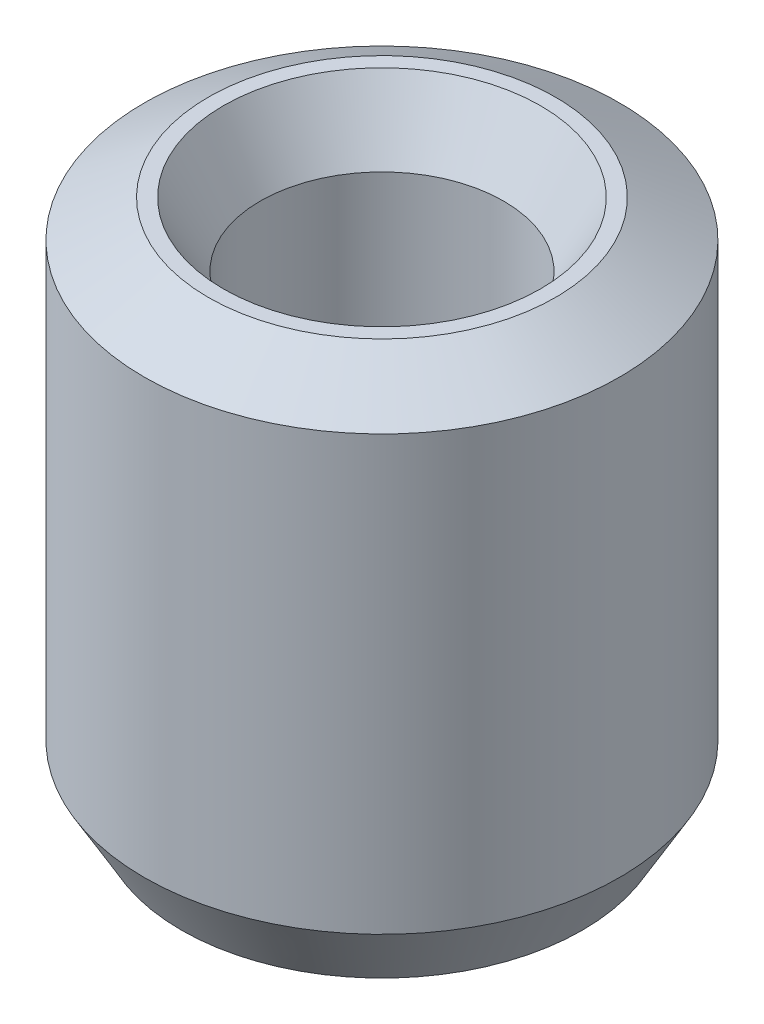
ISO-10303-21;
HEADER;
FILE_DESCRIPTION(('STEP AP214'),'2;1');
FILE_NAME('part.step','',(''),(''),'','','');
FILE_SCHEMA(('AUTOMOTIVE_DESIGN { 1 0 10303 214 1 1 1 1 }'));
ENDSEC;
DATA;
#1=APPLICATION_CONTEXT('core data for automotive mechanical design processes');
#2=APPLICATION_PROTOCOL_DEFINITION('international standard','automotive_design',2000,#1);
#3=PRODUCT_CONTEXT('',#1,'mechanical');
#4=PRODUCT('Part','Part','',(#3));
#5=PRODUCT_RELATED_PRODUCT_CATEGORY('part','',(#4));
#6=PRODUCT_DEFINITION_FORMATION('','',#4);
#7=PRODUCT_DEFINITION_CONTEXT('part definition',#1,'design');
#8=PRODUCT_DEFINITION('design','',#6,#7);
#9=PRODUCT_DEFINITION_SHAPE('','',#8);
#10=(LENGTH_UNIT() NAMED_UNIT(*) SI_UNIT(.MILLI.,.METRE.));
#11=(NAMED_UNIT(*) PLANE_ANGLE_UNIT() SI_UNIT($,.RADIAN.));
#12=(NAMED_UNIT(*) SI_UNIT($,.STERADIAN.) SOLID_ANGLE_UNIT());
#13=UNCERTAINTY_MEASURE_WITH_UNIT(LENGTH_MEASURE(1.E-05),#10,'distance_accuracy_value','');
#14=(GEOMETRIC_REPRESENTATION_CONTEXT(3) GLOBAL_UNCERTAINTY_ASSIGNED_CONTEXT((#13)) GLOBAL_UNIT_ASSIGNED_CONTEXT((#10,
#11,#12)) REPRESENTATION_CONTEXT('',''));
#15=CARTESIAN_POINT('',(0.,0.,0.));
#16=DIRECTION('',(0.,0.,1.));
#17=DIRECTION('',(1.,0.,0.));
#18=AXIS2_PLACEMENT_3D('',#15,#16,#17);
#19=CARTESIAN_POINT('',(0.,44.981452424539,0.));
#20=DIRECTION('',(0.,-1.,0.));
#21=DIRECTION('',(0.,0.,-1.));
#22=AXIS2_PLACEMENT_3D('',#19,#20,#21);
#23=CYLINDRICAL_SURFACE('',#22,20.);
#24=CARTESIAN_POINT('',(0.,5.3908314103205,0.));
#25=DIRECTION('',(0.,1.,0.));
#26=DIRECTION('',(0.,0.,1.));
#27=AXIS2_PLACEMENT_3D('',#24,#25,#26);
#28=CIRCLE('',#27,20.);
#29=CARTESIAN_POINT('',(0.,5.3908314103205,20.));
#30=VERTEX_POINT('',#29);
#31=EDGE_CURVE('E10',#30,#30,#28,.T.);
#32=ORIENTED_EDGE('',*,*,#31,.T.);
#33=EDGE_LOOP('',(#32));
#34=FACE_BOUND('',#33,.T.);
#35=CARTESIAN_POINT('',(0.,41.8690544586345,0.));
#36=DIRECTION('',(0.,1.,0.));
#37=DIRECTION('',(0.,0.,1.));
#38=AXIS2_PLACEMENT_3D('',#35,#36,#37);
#39=CIRCLE('',#38,20.);
#40=CARTESIAN_POINT('',(0.,41.8690544586345,20.));
#41=VERTEX_POINT('',#40);
#42=EDGE_CURVE('E50',#41,#41,#39,.F.);
#43=ORIENTED_EDGE('',*,*,#42,.T.);
#44=EDGE_LOOP('',(#43));
#45=FACE_BOUND('',#44,.T.);
#46=ADVANCED_FACE('F39',(#34,#45),#23,.T.);
#47=CARTESIAN_POINT('',(0.,44.981452424539,0.));
#48=DIRECTION('',(0.,1.,0.));
#49=DIRECTION('',(0.,0.,1.));
#50=AXIS2_PLACEMENT_3D('',#47,#48,#49);
#51=PLANE('',#50);
#52=CARTESIAN_POINT('',(0.,44.981452424539,0.));
#53=DIRECTION('',(0.,1.,0.));
#54=DIRECTION('',(0.,0.,1.));
#55=AXIS2_PLACEMENT_3D('',#52,#53,#54);
#56=CIRCLE('',#55,13.3536813190813);
#57=CARTESIAN_POINT('',(0.,44.981452424539,13.3536813190813));
#58=VERTEX_POINT('',#57);
#59=EDGE_CURVE('E58',#58,#58,#56,.F.);
#60=ORIENTED_EDGE('',*,*,#59,.T.);
#61=EDGE_LOOP('',(#60));
#62=FACE_BOUND('',#61,.T.);
#63=CARTESIAN_POINT('',(0.,44.981452424539,0.));
#64=DIRECTION('',(0.,1.,0.));
#65=DIRECTION('',(0.,0.,1.));
#66=AXIS2_PLACEMENT_3D('',#63,#64,#65);
#67=CIRCLE('',#66,14.6091685896795);
#68=CARTESIAN_POINT('',(0.,44.981452424539,14.6091685896795));
#69=VERTEX_POINT('',#68);
#70=EDGE_CURVE('E61',#69,#69,#67,.T.);
#71=ORIENTED_EDGE('',*,*,#70,.T.);
#72=EDGE_LOOP('',(#71));
#73=FACE_BOUND('',#72,.T.);
#74=ADVANCED_FACE('F88',(#62,#73),#51,.T.);
#75=CARTESIAN_POINT('',(0.,0.,0.));
#76=DIRECTION('',(0.,1.,0.));
#77=DIRECTION('',(0.,0.,1.));
#78=AXIS2_PLACEMENT_3D('',#75,#76,#77);
#79=PLANE('',#78);
#80=CARTESIAN_POINT('',(0.,0.,0.));
#81=DIRECTION('',(0.,1.,0.));
#82=DIRECTION('',(0.,0.,1.));
#83=AXIS2_PLACEMENT_3D('',#80,#81,#82);
#84=CIRCLE('',#83,15.6321147634974);
#85=CARTESIAN_POINT('',(0.,0.,15.6321147634974));
#86=VERTEX_POINT('',#85);
#87=EDGE_CURVE('E51',#86,#86,#84,.T.);
#88=ORIENTED_EDGE('',*,*,#87,.T.);
#89=EDGE_LOOP('',(#88));
#90=FACE_BOUND('',#89,.T.);
#91=CARTESIAN_POINT('',(0.,0.,0.));
#92=DIRECTION('',(0.,1.,0.));
#93=DIRECTION('',(0.,0.,1.));
#94=AXIS2_PLACEMENT_3D('',#91,#92,#93);
#95=CIRCLE('',#94,16.8876020340955);
#96=CARTESIAN_POINT('',(0.,0.,16.8876020340955));
#97=VERTEX_POINT('',#96);
#98=EDGE_CURVE('E54',#97,#97,#95,.F.);
#99=ORIENTED_EDGE('',*,*,#98,.T.);
#100=EDGE_LOOP('',(#99));
#101=FACE_BOUND('',#100,.T.);
#102=ADVANCED_FACE('F83',(#90,#101),#79,.F.);
#103=CARTESIAN_POINT('',(0.,44.981452424539,0.));
#104=DIRECTION('',(0.,-1.,0.));
#105=DIRECTION('',(0.,0.,-1.));
#106=AXIS2_PLACEMENT_3D('',#103,#104,#105);
#107=CYLINDRICAL_SURFACE('',#106,10.2412833531769);
#108=CARTESIAN_POINT('',(0.,39.5906210142185,0.));
#109=DIRECTION('',(0.,1.,0.));
#110=DIRECTION('',(0.,0.,1.));
#111=AXIS2_PLACEMENT_3D('',#108,#109,#110);
#112=CIRCLE('',#111,10.2412833531769);
#113=CARTESIAN_POINT('',(0.,39.5906210142185,10.2412833531768));
#114=VERTEX_POINT('',#113);
#115=EDGE_CURVE('E67',#114,#114,#112,.T.);
#116=ORIENTED_EDGE('',*,*,#115,.T.);
#117=EDGE_LOOP('',(#116));
#118=FACE_BOUND('',#117,.T.);
#119=CARTESIAN_POINT('',(0.,3.11239796590447,0.));
#120=DIRECTION('',(0.,1.,0.));
#121=DIRECTION('',(0.,0.,1.));
#122=AXIS2_PLACEMENT_3D('',#119,#120,#121);
#123=CIRCLE('',#122,10.2412833531769);
#124=CARTESIAN_POINT('',(0.,3.11239796590447,10.2412833531769));
#125=VERTEX_POINT('',#124);
#126=EDGE_CURVE('E69',#125,#125,#123,.F.);
#127=ORIENTED_EDGE('',*,*,#126,.T.);
#128=EDGE_LOOP('',(#127));
#129=FACE_BOUND('',#128,.T.);
#130=ADVANCED_FACE('F71',(#118,#129),#107,.F.);
#131=CARTESIAN_POINT('',(0.,39.5906210142185,0.));
#132=DIRECTION('',(0.,1.,0.));
#133=DIRECTION('',(0.,0.,1.));
#134=AXIS2_PLACEMENT_3D('',#131,#132,#133);
#135=CONICAL_SURFACE('',#134,10.2412833531769,0.523598775598303);
#136=CARTESIAN_POINT('',(0.,44.981452424539,13.3536813190813));
#137=CARTESIAN_POINT('',(0.,44.9252979306815,13.3212605069365));
#138=CARTESIAN_POINT('',(0.,44.869143436824,13.2888396947916));
#139=CARTESIAN_POINT('',(0.,44.7568344491089,13.2239980705019));
#140=CARTESIAN_POINT('',(0.,44.7006799552514,13.1915772583571));
#141=CARTESIAN_POINT('',(0.,44.5883709675364,13.1267356340674));
#142=CARTESIAN_POINT('',(0.,44.5322164736789,13.0943148219226));
#143=CARTESIAN_POINT('',(0.,44.4199074859639,13.0294731976329));
#144=CARTESIAN_POINT('',(0.,44.3637529921064,12.9970523854881));
#145=CARTESIAN_POINT('',(0.,44.2514440043914,12.9322107611984));
#146=CARTESIAN_POINT('',(0.,44.1952895105339,12.8997899490536));
#147=CARTESIAN_POINT('',(0.,44.0829805228189,12.8349483247639));
#148=CARTESIAN_POINT('',(0.,44.0268260289614,12.8025275126191));
#149=CARTESIAN_POINT('',(0.,43.9145170412464,12.7376858883294));
#150=CARTESIAN_POINT('',(0.,43.8583625473889,12.7052650761845));
#151=CARTESIAN_POINT('',(0.,43.7460535596738,12.6404234518949));
#152=CARTESIAN_POINT('',(0.,43.6898990658163,12.60800263975));
#153=CARTESIAN_POINT('',(0.,43.5775900781013,12.5431610154604));
#154=CARTESIAN_POINT('',(0.,43.5214355842438,12.5107402033155));
#155=CARTESIAN_POINT('',(0.,43.4091265965288,12.4458985790258));
#156=CARTESIAN_POINT('',(0.,43.3529721026713,12.413477766881));
#157=CARTESIAN_POINT('',(0.,43.2406631149563,12.3486361425913));
#158=CARTESIAN_POINT('',(0.,43.1845086210988,12.3162153304465));
#159=CARTESIAN_POINT('',(0.,43.0721996333838,12.2513737061568));
#160=CARTESIAN_POINT('',(0.,43.0160451395263,12.218952894012));
#161=CARTESIAN_POINT('',(0.,42.9037361518113,12.1541112697223));
#162=CARTESIAN_POINT('',(0.,42.8475816579538,12.1216904575775));
#163=CARTESIAN_POINT('',(0.,42.7352726702388,12.0568488332878));
#164=CARTESIAN_POINT('',(0.,42.6791181763813,12.0244280211429));
#165=CARTESIAN_POINT('',(0.,42.5668091886662,11.9595863968533));
#166=CARTESIAN_POINT('',(0.,42.5106546948087,11.9271655847084));
#167=CARTESIAN_POINT('',(0.,42.3983457070937,11.8623239604187));
#168=CARTESIAN_POINT('',(0.,42.3421912132362,11.8299031482739));
#169=CARTESIAN_POINT('',(0.,42.2298822255212,11.7650615239842));
#170=CARTESIAN_POINT('',(0.,42.1737277316637,11.7326407118394));
#171=CARTESIAN_POINT('',(0.,42.0614187439487,11.6677990875497));
#172=CARTESIAN_POINT('',(0.,42.0052642500912,11.6353782754049));
#173=CARTESIAN_POINT('',(0.,41.8929552623762,11.5705366511152));
#174=CARTESIAN_POINT('',(0.,41.8368007685187,11.5381158389704));
#175=CARTESIAN_POINT('',(0.,41.7244917808037,11.4732742146807));
#176=CARTESIAN_POINT('',(0.,41.6683372869462,11.4408534025359));
#177=CARTESIAN_POINT('',(0.,41.5560282992312,11.3760117782462));
#178=CARTESIAN_POINT('',(0.,41.4998738053736,11.3435909661013));
#179=CARTESIAN_POINT('',(0.,41.3875648176586,11.2787493418117));
#180=CARTESIAN_POINT('',(0.,41.3314103238011,11.2463285296668));
#181=CARTESIAN_POINT('',(0.,41.2191013360861,11.1814869053772));
#182=CARTESIAN_POINT('',(0.,41.1629468422286,11.1490660932323));
#183=CARTESIAN_POINT('',(0.,41.0506378545136,11.0842244689426));
#184=CARTESIAN_POINT('',(0.,40.9944833606561,11.0518036567978));
#185=CARTESIAN_POINT('',(0.,40.8821743729411,10.9869620325081));
#186=CARTESIAN_POINT('',(0.,40.8260198790836,10.9545412203633));
#187=CARTESIAN_POINT('',(0.,40.7137108913686,10.8896995960736));
#188=CARTESIAN_POINT('',(0.,40.6575563975111,10.8572787839288));
#189=CARTESIAN_POINT('',(0.,40.5452474097961,10.7924371596391));
#190=CARTESIAN_POINT('',(0.,40.4890929159386,10.7600163474943));
#191=CARTESIAN_POINT('',(0.,40.3767839282235,10.6951747232046));
#192=CARTESIAN_POINT('',(0.,40.320629434366,10.6627539110597));
#193=CARTESIAN_POINT('',(0.,40.208320446651,10.5979122867701));
#194=CARTESIAN_POINT('',(0.,40.1521659527935,10.5654914746252));
#195=CARTESIAN_POINT('',(0.,40.0398569650785,10.5006498503356));
#196=CARTESIAN_POINT('',(0.,39.983702471221,10.4682290381907));
#197=CARTESIAN_POINT('',(0.,39.871393483506,10.403387413901));
#198=CARTESIAN_POINT('',(0.,39.8152389896485,10.3709666017562));
#199=CARTESIAN_POINT('',(0.,39.7029300019335,10.3061249774665));
#200=CARTESIAN_POINT('',(0.,39.646775508076,10.2737041653217));
#201=CARTESIAN_POINT('',(0.,39.5906210142185,10.2412833531768));
#202=B_SPLINE_CURVE_WITH_KNOTS('',3,(#136,#137,#138,#139,#140,#141,#142,#143,#144,#145,#146,
#147,#148,#149,#150,#151,#152,#153,#154,#155,#156,#157,#158,#159,#160,#161,#162,#163,#164,#165,
#166,#167,#168,#169,#170,#171,#172,#173,#174,#175,#176,#177,#178,#179,#180,#181,#182,#183,#184,
#185,#186,#187,#188,#189,#190,#191,#192,#193,#194,#195,#196,#197,#198,#199,#200,#201),
.UNSPECIFIED.,.F.,.F.,(4,2,2,2,2,2,2,2,2,2,2,2,2,2,2,2,2,2,2,2,2,2,2,2,2,2,2,2,2,2,2,2,4),(0.,
0.194524872869024,0.389049745738054,0.583574618607078,0.778099491476108,0.972624364345131,
1.16714923721416,1.36167411008318,1.55619898295221,1.75072385582124,1.94524872869027,
2.13977360155929,2.33429847442832,2.52882334729735,2.72334822016638,2.9178730930354,
3.11239796590443,3.30692283877345,3.50144771164248,3.69597258451151,3.89049745738054,
4.08502233024956,4.27954720311859,4.47407207598761,4.66859694885664,4.86312182172567,
5.0576466945947,5.25217156746372,5.44669644033275,5.64122131320178,5.83574618607081,
6.03027105893983,6.22479593180886),.UNSPECIFIED.);
#203=EDGE_CURVE('BSEAM77',#58,#114,#202,.T.);
#204=ORIENTED_EDGE('',*,*,#59,.F.);
#205=ORIENTED_EDGE('',*,*,#115,.F.);
#206=ORIENTED_EDGE('',*,*,#203,.T.);
#207=ORIENTED_EDGE('',*,*,#203,.F.);
#208=EDGE_LOOP('',(#204,#206,#205,#207));
#209=FACE_BOUND('',#208,.T.);
#210=ADVANCED_FACE('F77',(#209),#135,.F.);
#211=CARTESIAN_POINT('',(0.,0.,0.));
#212=DIRECTION('',(0.,-1.,0.));
#213=DIRECTION('',(0.,0.,-1.));
#214=AXIS2_PLACEMENT_3D('',#211,#212,#213);
#215=CONICAL_SURFACE('',#214,15.6321147634974,1.04719755119659);
#216=ORIENTED_EDGE('',*,*,#126,.F.);
#217=EDGE_LOOP('',(#216));
#218=FACE_BOUND('',#217,.T.);
#219=ORIENTED_EDGE('',*,*,#87,.F.);
#220=EDGE_LOOP('',(#219));
#221=FACE_BOUND('',#220,.T.);
#222=ADVANCED_FACE('F73',(#218,#221),#215,.F.);
#223=CARTESIAN_POINT('',(0.,5.3908314103205,0.));
#224=DIRECTION('',(0.,1.,0.));
#225=DIRECTION('',(0.,0.,1.));
#226=AXIS2_PLACEMENT_3D('',#223,#224,#225);
#227=CONICAL_SURFACE('',#226,20.,0.523598775598303);
#228=ORIENTED_EDGE('',*,*,#98,.F.);
#229=EDGE_LOOP('',(#228));
#230=FACE_BOUND('',#229,.T.);
#231=ORIENTED_EDGE('',*,*,#31,.F.);
#232=EDGE_LOOP('',(#231));
#233=FACE_BOUND('',#232,.T.);
#234=ADVANCED_FACE('F76',(#230,#233),#227,.T.);
#235=CARTESIAN_POINT('',(0.,44.981452424539,0.));
#236=DIRECTION('',(0.,-1.,0.));
#237=DIRECTION('',(0.,0.,-1.));
#238=AXIS2_PLACEMENT_3D('',#235,#236,#237);
#239=CONICAL_SURFACE('',#238,14.6091685896795,1.04719755119659);
#240=ORIENTED_EDGE('',*,*,#42,.F.);
#241=EDGE_LOOP('',(#240));
#242=FACE_BOUND('',#241,.T.);
#243=ORIENTED_EDGE('',*,*,#70,.F.);
#244=EDGE_LOOP('',(#243));
#245=FACE_BOUND('',#244,.T.);
#246=ADVANCED_FACE('F45',(#242,#245),#239,.T.);
#247=CLOSED_SHELL('',(#46,#74,#102,#130,#210,#222,#234,#246));
#248=MANIFOLD_SOLID_BREP('B2',#247);
#249=ADVANCED_BREP_SHAPE_REPRESENTATION('',(#18,#248),#14);
#250=SHAPE_DEFINITION_REPRESENTATION(#9,#249);
ENDSEC;
END-ISO-10303-21;
